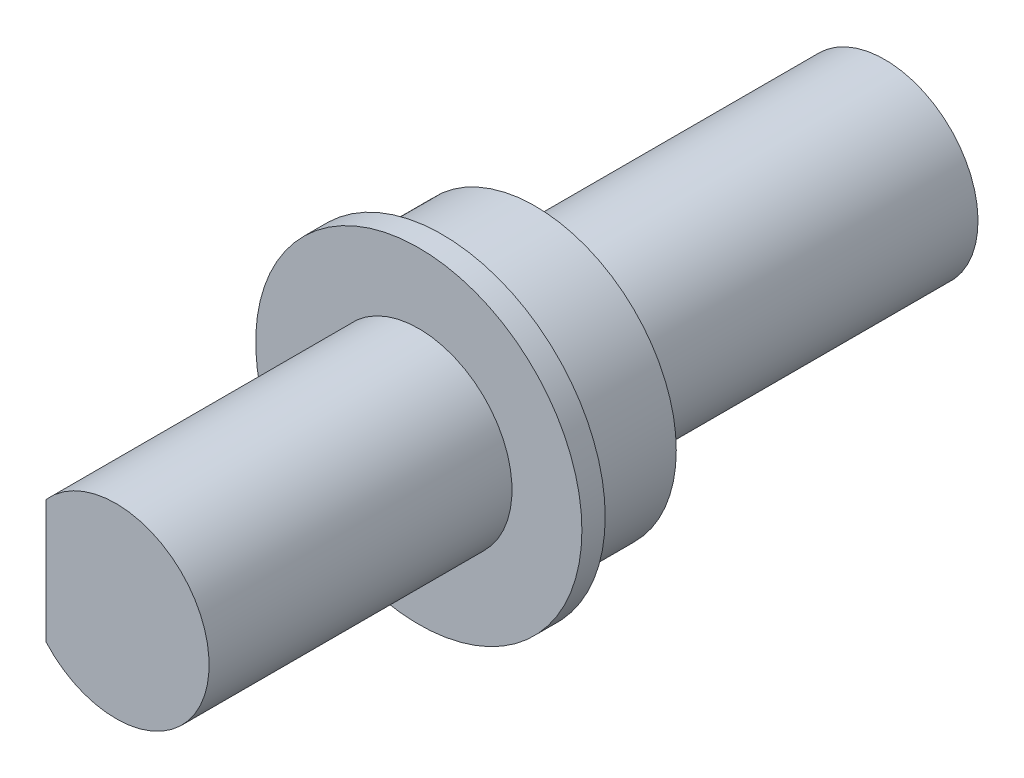
ISO-10303-21;
HEADER;
FILE_DESCRIPTION(('STEP AP214'),'2;1');
FILE_NAME('part.step','',(''),(''),'','','');
FILE_SCHEMA(('AUTOMOTIVE_DESIGN { 1 0 10303 214 1 1 1 1 }'));
ENDSEC;
DATA;
#1=APPLICATION_CONTEXT('core data for automotive mechanical design processes');
#2=APPLICATION_PROTOCOL_DEFINITION('international standard','automotive_design',2000,#1);
#3=PRODUCT_CONTEXT('',#1,'mechanical');
#4=PRODUCT('Part','Part','',(#3));
#5=PRODUCT_RELATED_PRODUCT_CATEGORY('part','',(#4));
#6=PRODUCT_DEFINITION_FORMATION('','',#4);
#7=PRODUCT_DEFINITION_CONTEXT('part definition',#1,'design');
#8=PRODUCT_DEFINITION('design','',#6,#7);
#9=PRODUCT_DEFINITION_SHAPE('','',#8);
#10=(LENGTH_UNIT() NAMED_UNIT(*) SI_UNIT(.MILLI.,.METRE.));
#11=(NAMED_UNIT(*) PLANE_ANGLE_UNIT() SI_UNIT($,.RADIAN.));
#12=(NAMED_UNIT(*) SI_UNIT($,.STERADIAN.) SOLID_ANGLE_UNIT());
#13=UNCERTAINTY_MEASURE_WITH_UNIT(LENGTH_MEASURE(1.E-05),#10,'distance_accuracy_value','');
#14=(GEOMETRIC_REPRESENTATION_CONTEXT(3) GLOBAL_UNCERTAINTY_ASSIGNED_CONTEXT((#13)) GLOBAL_UNIT_ASSIGNED_CONTEXT((#10,
#11,#12)) REPRESENTATION_CONTEXT('',''));
#15=CARTESIAN_POINT('',(0.,0.,0.));
#16=DIRECTION('',(0.,0.,1.));
#17=DIRECTION('',(1.,0.,0.));
#18=AXIS2_PLACEMENT_3D('',#15,#16,#17);
#19=CARTESIAN_POINT('',(0.,0.,5.));
#20=DIRECTION('',(0.,0.,-1.));
#21=DIRECTION('',(-1.,0.,0.));
#22=AXIS2_PLACEMENT_3D('',#19,#20,#21);
#23=CYLINDRICAL_SURFACE('',#22,6.05);
#24=CARTESIAN_POINT('',(0.,0.,0.));
#25=DIRECTION('',(0.,0.,1.));
#26=DIRECTION('',(1.,0.,0.));
#27=AXIS2_PLACEMENT_3D('',#24,#25,#26);
#28=CIRCLE('',#27,6.05);
#29=CARTESIAN_POINT('',(6.05,0.,0.));
#30=VERTEX_POINT('',#29);
#31=EDGE_CURVE('E48',#30,#30,#28,.T.);
#32=ORIENTED_EDGE('',*,*,#31,.T.);
#33=EDGE_LOOP('',(#32));
#34=FACE_BOUND('',#33,.T.);
#35=CARTESIAN_POINT('',(0.,0.,4.));
#36=DIRECTION('',(0.,0.,1.));
#37=DIRECTION('',(1.,0.,0.));
#38=AXIS2_PLACEMENT_3D('',#35,#36,#37);
#39=CIRCLE('',#38,6.05);
#40=CARTESIAN_POINT('',(6.05,0.,4.));
#41=VERTEX_POINT('',#40);
#42=EDGE_CURVE('E11',#41,#41,#39,.T.);
#43=ORIENTED_EDGE('',*,*,#42,.F.);
#44=EDGE_LOOP('',(#43));
#45=FACE_BOUND('',#44,.T.);
#46=ADVANCED_FACE('F41',(#34,#45),#23,.T.);
#47=CARTESIAN_POINT('',(0.,0.,0.));
#48=DIRECTION('',(0.,0.,1.));
#49=DIRECTION('',(1.,0.,0.));
#50=AXIS2_PLACEMENT_3D('',#47,#48,#49);
#51=PLANE('',#50);
#52=DIRECTION('',(-1.,0.,0.));
#53=VECTOR('',#52,1.);
#54=CARTESIAN_POINT('',(0.,-3.,0.));
#55=LINE('',#54,#53);
#56=CARTESIAN_POINT('',(2.64575131106459,-3.,0.));
#57=VERTEX_POINT('',#56);
#58=CARTESIAN_POINT('',(-2.64575131106459,-3.,0.));
#59=VERTEX_POINT('',#58);
#60=EDGE_CURVE('E96',#57,#59,#55,.T.);
#61=ORIENTED_EDGE('',*,*,#60,.F.);
#62=CARTESIAN_POINT('',(0.,0.,0.));
#63=DIRECTION('',(0.,0.,-1.));
#64=DIRECTION('',(-1.,0.,0.));
#65=AXIS2_PLACEMENT_3D('',#62,#63,#64);
#66=CIRCLE('',#65,4.);
#67=EDGE_CURVE('E54',#59,#57,#66,.T.);
#68=ORIENTED_EDGE('',*,*,#67,.F.);
#69=EDGE_LOOP('',(#61,#68));
#70=FACE_BOUND('',#69,.T.);
#71=ORIENTED_EDGE('',*,*,#31,.F.);
#72=EDGE_LOOP('',(#71));
#73=FACE_BOUND('',#72,.T.);
#74=ADVANCED_FACE('F125',(#70,#73),#51,.F.);
#75=CARTESIAN_POINT('',(0.,0.,4.));
#76=DIRECTION('',(0.,0.,1.));
#77=DIRECTION('',(1.,0.,0.));
#78=AXIS2_PLACEMENT_3D('',#75,#76,#77);
#79=CYLINDRICAL_SURFACE('',#78,7.);
#80=CARTESIAN_POINT('',(0.,0.,4.));
#81=DIRECTION('',(0.,0.,1.));
#82=DIRECTION('',(1.,0.,0.));
#83=AXIS2_PLACEMENT_3D('',#80,#81,#82);
#84=CIRCLE('',#83,7.);
#85=CARTESIAN_POINT('',(7.,0.,4.));
#86=VERTEX_POINT('',#85);
#87=EDGE_CURVE('E116',#86,#86,#84,.T.);
#88=ORIENTED_EDGE('',*,*,#87,.T.);
#89=EDGE_LOOP('',(#88));
#90=FACE_BOUND('',#89,.T.);
#91=CARTESIAN_POINT('',(0.,0.,5.));
#92=DIRECTION('',(0.,0.,1.));
#93=DIRECTION('',(1.,0.,0.));
#94=AXIS2_PLACEMENT_3D('',#91,#92,#93);
#95=CIRCLE('',#94,7.);
#96=CARTESIAN_POINT('',(7.,0.,5.));
#97=VERTEX_POINT('',#96);
#98=EDGE_CURVE('E115',#97,#97,#95,.T.);
#99=ORIENTED_EDGE('',*,*,#98,.F.);
#100=EDGE_LOOP('',(#99));
#101=FACE_BOUND('',#100,.T.);
#102=ADVANCED_FACE('F127',(#90,#101),#79,.T.);
#103=CARTESIAN_POINT('',(0.,0.,4.));
#104=DIRECTION('',(0.,0.,1.));
#105=DIRECTION('',(1.,0.,0.));
#106=AXIS2_PLACEMENT_3D('',#103,#104,#105);
#107=PLANE('',#106);
#108=ORIENTED_EDGE('',*,*,#42,.T.);
#109=EDGE_LOOP('',(#108));
#110=FACE_BOUND('',#109,.T.);
#111=ORIENTED_EDGE('',*,*,#87,.F.);
#112=EDGE_LOOP('',(#111));
#113=FACE_BOUND('',#112,.T.);
#114=ADVANCED_FACE('F132',(#110,#113),#107,.F.);
#115=CARTESIAN_POINT('',(0.,0.,5.));
#116=DIRECTION('',(0.,0.,1.));
#117=DIRECTION('',(1.,0.,0.));
#118=AXIS2_PLACEMENT_3D('',#115,#116,#117);
#119=PLANE('',#118);
#120=DIRECTION('',(0.,-1.,0.));
#121=VECTOR('',#120,1.);
#122=CARTESIAN_POINT('',(-3.,0.,5.));
#123=LINE('',#122,#121);
#124=CARTESIAN_POINT('',(-3.,2.64575131106459,5.));
#125=VERTEX_POINT('',#124);
#126=CARTESIAN_POINT('',(-3.,-2.64575131106459,5.));
#127=VERTEX_POINT('',#126);
#128=EDGE_CURVE('E97',#125,#127,#123,.T.);
#129=ORIENTED_EDGE('',*,*,#128,.F.);
#130=CARTESIAN_POINT('',(0.,0.,5.));
#131=DIRECTION('',(0.,0.,1.));
#132=DIRECTION('',(1.,0.,0.));
#133=AXIS2_PLACEMENT_3D('',#130,#131,#132);
#134=CIRCLE('',#133,4.);
#135=EDGE_CURVE('E61',#127,#125,#134,.T.);
#136=ORIENTED_EDGE('',*,*,#135,.F.);
#137=EDGE_LOOP('',(#129,#136));
#138=FACE_BOUND('',#137,.T.);
#139=ORIENTED_EDGE('',*,*,#98,.T.);
#140=EDGE_LOOP('',(#139));
#141=FACE_BOUND('',#140,.T.);
#142=ADVANCED_FACE('F136',(#138,#141),#119,.T.);
#143=CARTESIAN_POINT('',(-3.,0.,18.));
#144=DIRECTION('',(1.,0.,0.));
#145=DIRECTION('',(0.,0.,-1.));
#146=AXIS2_PLACEMENT_3D('',#143,#144,#145);
#147=PLANE('',#146);
#148=ORIENTED_EDGE('',*,*,#128,.T.);
#149=DIRECTION('',(0.,0.,-1.));
#150=VECTOR('',#149,1.);
#151=CARTESIAN_POINT('',(-3.,-2.64575131106459,18.));
#152=LINE('',#151,#150);
#153=CARTESIAN_POINT('',(-3.,-2.64575131106459,18.));
#154=VERTEX_POINT('',#153);
#155=EDGE_CURVE('E113',#154,#127,#152,.T.);
#156=ORIENTED_EDGE('',*,*,#155,.F.);
#157=DIRECTION('',(0.,-1.,0.));
#158=VECTOR('',#157,1.);
#159=CARTESIAN_POINT('',(-3.,0.,18.));
#160=LINE('',#159,#158);
#161=CARTESIAN_POINT('',(-3.,2.64575131106459,18.));
#162=VERTEX_POINT('',#161);
#163=EDGE_CURVE('E104',#162,#154,#160,.T.);
#164=ORIENTED_EDGE('',*,*,#163,.F.);
#165=DIRECTION('',(0.,0.,-1.));
#166=VECTOR('',#165,1.);
#167=CARTESIAN_POINT('',(-3.,2.64575131106459,18.));
#168=LINE('',#167,#166);
#169=EDGE_CURVE('E108',#162,#125,#168,.T.);
#170=ORIENTED_EDGE('',*,*,#169,.T.);
#171=EDGE_LOOP('',(#148,#156,#164,#170));
#172=FACE_BOUND('',#171,.T.);
#173=ADVANCED_FACE('F138',(#172),#147,.F.);
#174=CARTESIAN_POINT('',(0.,0.,18.));
#175=DIRECTION('',(0.,0.,-1.));
#176=DIRECTION('',(-1.,0.,0.));
#177=AXIS2_PLACEMENT_3D('',#174,#175,#176);
#178=CYLINDRICAL_SURFACE('',#177,4.);
#179=ORIENTED_EDGE('',*,*,#135,.T.);
#180=ORIENTED_EDGE('',*,*,#169,.F.);
#181=CARTESIAN_POINT('',(0.,0.,18.));
#182=DIRECTION('',(0.,0.,1.));
#183=DIRECTION('',(1.,0.,0.));
#184=AXIS2_PLACEMENT_3D('',#181,#182,#183);
#185=CIRCLE('',#184,4.);
#186=EDGE_CURVE('E107',#154,#162,#185,.T.);
#187=ORIENTED_EDGE('',*,*,#186,.F.);
#188=ORIENTED_EDGE('',*,*,#155,.T.);
#189=EDGE_LOOP('',(#179,#180,#187,#188));
#190=FACE_BOUND('',#189,.T.);
#191=ADVANCED_FACE('F145',(#190),#178,.T.);
#192=CARTESIAN_POINT('',(0.,0.,18.));
#193=DIRECTION('',(0.,0.,1.));
#194=DIRECTION('',(1.,0.,0.));
#195=AXIS2_PLACEMENT_3D('',#192,#193,#194);
#196=PLANE('',#195);
#197=ORIENTED_EDGE('',*,*,#163,.T.);
#198=ORIENTED_EDGE('',*,*,#186,.T.);
#199=EDGE_LOOP('',(#197,#198));
#200=FACE_BOUND('',#199,.T.);
#201=ADVANCED_FACE('F149',(#200),#196,.T.);
#202=CARTESIAN_POINT('',(0.,-3.,-15.));
#203=DIRECTION('',(0.,1.,0.));
#204=DIRECTION('',(0.,0.,1.));
#205=AXIS2_PLACEMENT_3D('',#202,#203,#204);
#206=PLANE('',#205);
#207=ORIENTED_EDGE('',*,*,#60,.T.);
#208=DIRECTION('',(0.,0.,1.));
#209=VECTOR('',#208,1.);
#210=CARTESIAN_POINT('',(-2.64575131106459,-3.,-15.));
#211=LINE('',#210,#209);
#212=CARTESIAN_POINT('',(-2.64575131106459,-3.,-15.));
#213=VERTEX_POINT('',#212);
#214=EDGE_CURVE('E84',#213,#59,#211,.T.);
#215=ORIENTED_EDGE('',*,*,#214,.F.);
#216=DIRECTION('',(-1.,0.,0.));
#217=VECTOR('',#216,1.);
#218=CARTESIAN_POINT('',(0.,-3.,-15.));
#219=LINE('',#218,#217);
#220=CARTESIAN_POINT('',(2.64575131106459,-3.,-15.));
#221=VERTEX_POINT('',#220);
#222=EDGE_CURVE('E90',#221,#213,#219,.T.);
#223=ORIENTED_EDGE('',*,*,#222,.F.);
#224=DIRECTION('',(0.,0.,1.));
#225=VECTOR('',#224,1.);
#226=CARTESIAN_POINT('',(2.64575131106459,-3.,-15.));
#227=LINE('',#226,#225);
#228=EDGE_CURVE('E87',#221,#57,#227,.T.);
#229=ORIENTED_EDGE('',*,*,#228,.T.);
#230=EDGE_LOOP('',(#207,#215,#223,#229));
#231=FACE_BOUND('',#230,.T.);
#232=ADVANCED_FACE('F95',(#231),#206,.F.);
#233=CARTESIAN_POINT('',(0.,0.,-15.));
#234=DIRECTION('',(0.,0.,1.));
#235=DIRECTION('',(1.,0.,0.));
#236=AXIS2_PLACEMENT_3D('',#233,#234,#235);
#237=CYLINDRICAL_SURFACE('',#236,4.);
#238=ORIENTED_EDGE('',*,*,#67,.T.);
#239=ORIENTED_EDGE('',*,*,#228,.F.);
#240=CARTESIAN_POINT('',(0.,0.,-15.));
#241=DIRECTION('',(0.,0.,-1.));
#242=DIRECTION('',(-1.,0.,0.));
#243=AXIS2_PLACEMENT_3D('',#240,#241,#242);
#244=CIRCLE('',#243,4.);
#245=EDGE_CURVE('E80',#213,#221,#244,.T.);
#246=ORIENTED_EDGE('',*,*,#245,.F.);
#247=ORIENTED_EDGE('',*,*,#214,.T.);
#248=EDGE_LOOP('',(#238,#239,#246,#247));
#249=FACE_BOUND('',#248,.T.);
#250=ADVANCED_FACE('F82',(#249),#237,.T.);
#251=CARTESIAN_POINT('',(0.,0.,-15.));
#252=DIRECTION('',(0.,0.,-1.));
#253=DIRECTION('',(-1.,0.,0.));
#254=AXIS2_PLACEMENT_3D('',#251,#252,#253);
#255=PLANE('',#254);
#256=ORIENTED_EDGE('',*,*,#222,.T.);
#257=ORIENTED_EDGE('',*,*,#245,.T.);
#258=EDGE_LOOP('',(#256,#257));
#259=FACE_BOUND('',#258,.T.);
#260=ADVANCED_FACE('F92',(#259),#255,.T.);
#261=CLOSED_SHELL('',(#46,#74,#102,#114,#142,#173,#191,#201,#232,#250,#260));
#262=MANIFOLD_SOLID_BREP('B2',#261);
#263=ADVANCED_BREP_SHAPE_REPRESENTATION('',(#18,#262),#14);
#264=SHAPE_DEFINITION_REPRESENTATION(#9,#263);
ENDSEC;
END-ISO-10303-21;
